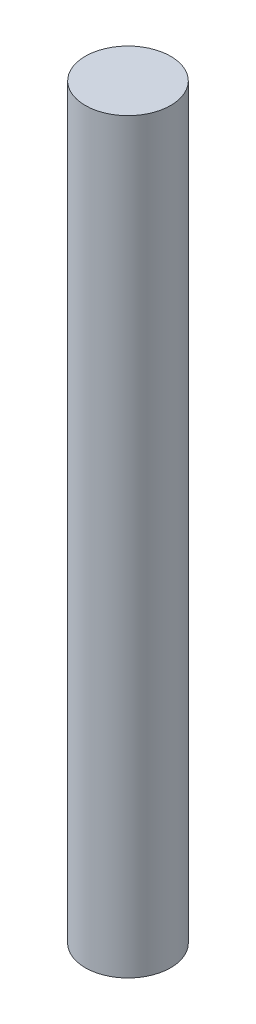
ISO-10303-21;
HEADER;
FILE_DESCRIPTION(('STEP AP214'),'2;1');
FILE_NAME('part.step','',(''),(''),'','','');
FILE_SCHEMA(('AUTOMOTIVE_DESIGN { 1 0 10303 214 1 1 1 1 }'));
ENDSEC;
DATA;
#1=APPLICATION_CONTEXT('core data for automotive mechanical design processes');
#2=APPLICATION_PROTOCOL_DEFINITION('international standard','automotive_design',2000,#1);
#3=PRODUCT_CONTEXT('',#1,'mechanical');
#4=PRODUCT('Part','Part','',(#3));
#5=PRODUCT_RELATED_PRODUCT_CATEGORY('part','',(#4));
#6=PRODUCT_DEFINITION_FORMATION('','',#4);
#7=PRODUCT_DEFINITION_CONTEXT('part definition',#1,'design');
#8=PRODUCT_DEFINITION('design','',#6,#7);
#9=PRODUCT_DEFINITION_SHAPE('','',#8);
#10=(LENGTH_UNIT() NAMED_UNIT(*) SI_UNIT(.MILLI.,.METRE.));
#11=(NAMED_UNIT(*) PLANE_ANGLE_UNIT() SI_UNIT($,.RADIAN.));
#12=(NAMED_UNIT(*) SI_UNIT($,.STERADIAN.) SOLID_ANGLE_UNIT());
#13=UNCERTAINTY_MEASURE_WITH_UNIT(LENGTH_MEASURE(1.E-05),#10,'distance_accuracy_value','');
#14=(GEOMETRIC_REPRESENTATION_CONTEXT(3) GLOBAL_UNCERTAINTY_ASSIGNED_CONTEXT((#13)) GLOBAL_UNIT_ASSIGNED_CONTEXT((#10,
#11,#12)) REPRESENTATION_CONTEXT('',''));
#15=CARTESIAN_POINT('',(0.,0.,0.));
#16=DIRECTION('',(0.,0.,1.));
#17=DIRECTION('',(1.,0.,0.));
#18=AXIS2_PLACEMENT_3D('',#15,#16,#17);
#19=CARTESIAN_POINT('',(0.,70.,0.));
#20=DIRECTION('',(0.,-1.,0.));
#21=DIRECTION('',(0.,0.,-1.));
#22=AXIS2_PLACEMENT_3D('',#19,#20,#21);
#23=CYLINDRICAL_SURFACE('',#22,4.);
#24=CARTESIAN_POINT('',(0.,70.,0.));
#25=DIRECTION('',(0.,1.,0.));
#26=DIRECTION('',(0.,0.,1.));
#27=AXIS2_PLACEMENT_3D('',#24,#25,#26);
#28=CIRCLE('',#27,4.);
#29=CARTESIAN_POINT('',(0.,70.,4.));
#30=VERTEX_POINT('',#29);
#31=EDGE_CURVE('E10',#30,#30,#28,.T.);
#32=ORIENTED_EDGE('',*,*,#31,.F.);
#33=EDGE_LOOP('',(#32));
#34=FACE_BOUND('',#33,.T.);
#35=CARTESIAN_POINT('',(0.,0.,0.));
#36=DIRECTION('',(0.,1.,0.));
#37=DIRECTION('',(0.,0.,1.));
#38=AXIS2_PLACEMENT_3D('',#35,#36,#37);
#39=CIRCLE('',#38,4.);
#40=CARTESIAN_POINT('',(0.,0.,4.));
#41=VERTEX_POINT('',#40);
#42=EDGE_CURVE('E34',#41,#41,#39,.T.);
#43=ORIENTED_EDGE('',*,*,#42,.T.);
#44=EDGE_LOOP('',(#43));
#45=FACE_BOUND('',#44,.T.);
#46=ADVANCED_FACE('F31',(#34,#45),#23,.T.);
#47=CARTESIAN_POINT('',(0.,70.,0.));
#48=DIRECTION('',(0.,1.,0.));
#49=DIRECTION('',(0.,0.,1.));
#50=AXIS2_PLACEMENT_3D('',#47,#48,#49);
#51=PLANE('',#50);
#52=ORIENTED_EDGE('',*,*,#31,.T.);
#53=EDGE_LOOP('',(#52));
#54=FACE_BOUND('',#53,.T.);
#55=ADVANCED_FACE('F46',(#54),#51,.T.);
#56=CARTESIAN_POINT('',(0.,0.,0.));
#57=DIRECTION('',(0.,1.,0.));
#58=DIRECTION('',(0.,0.,1.));
#59=AXIS2_PLACEMENT_3D('',#56,#57,#58);
#60=PLANE('',#59);
#61=ORIENTED_EDGE('',*,*,#42,.F.);
#62=EDGE_LOOP('',(#61));
#63=FACE_BOUND('',#62,.T.);
#64=ADVANCED_FACE('F44',(#63),#60,.F.);
#65=CLOSED_SHELL('',(#46,#55,#64));
#66=MANIFOLD_SOLID_BREP('B2',#65);
#67=ADVANCED_BREP_SHAPE_REPRESENTATION('',(#18,#66),#14);
#68=SHAPE_DEFINITION_REPRESENTATION(#9,#67);
ENDSEC;
END-ISO-10303-21;
